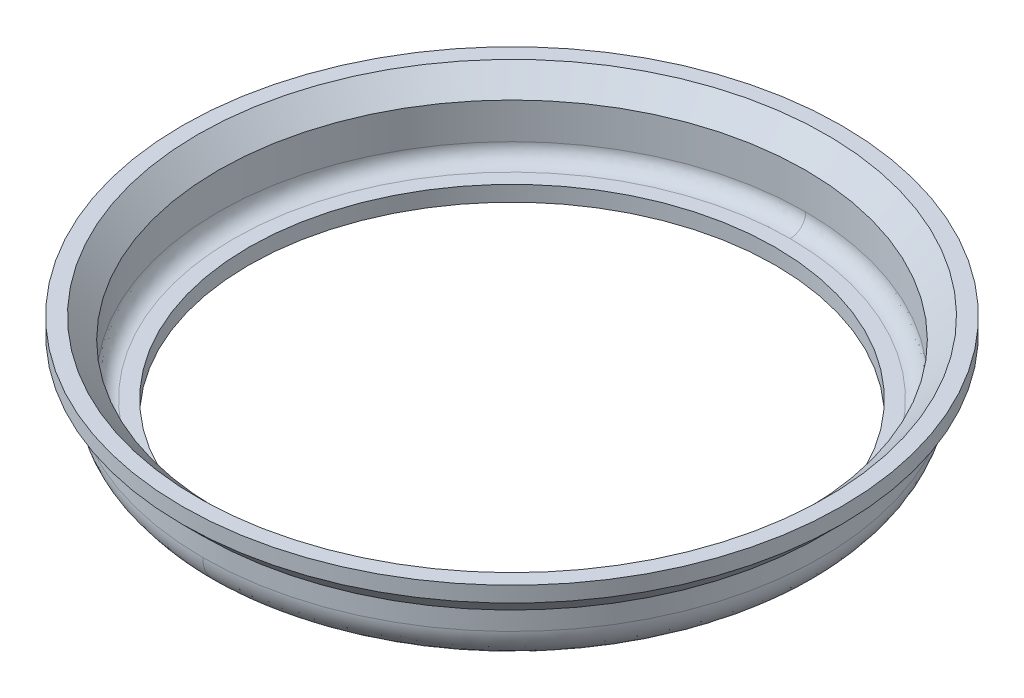
ISO-10303-21;
HEADER;
FILE_DESCRIPTION(('STEP AP214'),'2;1');
FILE_NAME('part.step','',(''),(''),'','','');
FILE_SCHEMA(('AUTOMOTIVE_DESIGN { 1 0 10303 214 1 1 1 1 }'));
ENDSEC;
DATA;
#1=APPLICATION_CONTEXT('core data for automotive mechanical design processes');
#2=APPLICATION_PROTOCOL_DEFINITION('international standard','automotive_design',2000,#1);
#3=PRODUCT_CONTEXT('',#1,'mechanical');
#4=PRODUCT('Part','Part','',(#3));
#5=PRODUCT_RELATED_PRODUCT_CATEGORY('part','',(#4));
#6=PRODUCT_DEFINITION_FORMATION('','',#4);
#7=PRODUCT_DEFINITION_CONTEXT('part definition',#1,'design');
#8=PRODUCT_DEFINITION('design','',#6,#7);
#9=PRODUCT_DEFINITION_SHAPE('','',#8);
#10=(LENGTH_UNIT() NAMED_UNIT(*) SI_UNIT(.MILLI.,.METRE.));
#11=(NAMED_UNIT(*) PLANE_ANGLE_UNIT() SI_UNIT($,.RADIAN.));
#12=(NAMED_UNIT(*) SI_UNIT($,.STERADIAN.) SOLID_ANGLE_UNIT());
#13=UNCERTAINTY_MEASURE_WITH_UNIT(LENGTH_MEASURE(1.E-05),#10,'distance_accuracy_value','');
#14=(GEOMETRIC_REPRESENTATION_CONTEXT(3) GLOBAL_UNCERTAINTY_ASSIGNED_CONTEXT((#13)) GLOBAL_UNIT_ASSIGNED_CONTEXT((#10,
#11,#12)) REPRESENTATION_CONTEXT('',''));
#15=CARTESIAN_POINT('',(0.,0.,0.));
#16=DIRECTION('',(0.,0.,1.));
#17=DIRECTION('',(1.,0.,0.));
#18=AXIS2_PLACEMENT_3D('',#15,#16,#17);
#19=CARTESIAN_POINT('',(-8.225536,2.159,-8.225536));
#20=DIRECTION('',(0.,1.,0.));
#21=DIRECTION('',(0.,0.,1.));
#22=AXIS2_PLACEMENT_3D('',#19,#20,#21);
#23=PLANE('',#22);
#24=CARTESIAN_POINT('',(0.,2.159,0.));
#25=DIRECTION('',(0.,1.,0.));
#26=DIRECTION('',(-1.,0.,0.));
#27=AXIS2_PLACEMENT_3D('',#24,#25,#26);
#28=CIRCLE('',#27,7.747);
#29=CARTESIAN_POINT('',(-7.747,2.159,0.));
#30=VERTEX_POINT('',#29);
#31=EDGE_CURVE('E237',#30,#30,#28,.T.);
#32=ORIENTED_EDGE('',*,*,#31,.F.);
#33=EDGE_LOOP('',(#32));
#34=FACE_BOUND('',#33,.T.);
#35=CARTESIAN_POINT('',(0.,2.159,0.));
#36=DIRECTION('',(0.,-1.,0.));
#37=DIRECTION('',(1.,0.,0.));
#38=AXIS2_PLACEMENT_3D('',#35,#36,#37);
#39=CIRCLE('',#38,8.128);
#40=CARTESIAN_POINT('',(8.128,2.159,0.));
#41=VERTEX_POINT('',#40);
#42=EDGE_CURVE('E21',#41,#41,#39,.F.);
#43=ORIENTED_EDGE('',*,*,#42,.T.);
#44=EDGE_LOOP('',(#43));
#45=FACE_BOUND('',#44,.T.);
#46=ADVANCED_FACE('F16',(#34,#45),#23,.T.);
#47=CARTESIAN_POINT('',(0.,2.159,0.));
#48=DIRECTION('',(0.,-1.,0.));
#49=DIRECTION('',(1.,0.,0.));
#50=AXIS2_PLACEMENT_3D('',#47,#48,#49);
#51=CYLINDRICAL_SURFACE('',#50,8.128);
#52=ORIENTED_EDGE('',*,*,#42,.F.);
#53=EDGE_LOOP('',(#52));
#54=FACE_BOUND('',#53,.T.);
#55=CARTESIAN_POINT('',(0.,1.77799999999995,0.));
#56=DIRECTION('',(0.,1.,0.));
#57=DIRECTION('',(0.,0.,1.));
#58=AXIS2_PLACEMENT_3D('',#55,#56,#57);
#59=CIRCLE('',#58,8.128);
#60=CARTESIAN_POINT('',(0.,1.778,8.128));
#61=VERTEX_POINT('',#60);
#62=EDGE_CURVE('E239',#61,#61,#59,.T.);
#63=ORIENTED_EDGE('',*,*,#62,.T.);
#64=EDGE_LOOP('',(#63));
#65=FACE_BOUND('',#64,.T.);
#66=ADVANCED_FACE('F132',(#54,#65),#51,.T.);
#67=CARTESIAN_POINT('',(0.,1.651,0.));
#68=DIRECTION('',(0.,1.,0.));
#69=DIRECTION('',(-1.,0.,0.));
#70=AXIS2_PLACEMENT_3D('',#67,#68,#69);
#71=CONICAL_SURFACE('',#70,7.239,0.785398163397449);
#72=ORIENTED_EDGE('',*,*,#31,.T.);
#73=EDGE_LOOP('',(#72));
#74=FACE_BOUND('',#73,.T.);
#75=CARTESIAN_POINT('',(0.,1.651,0.));
#76=DIRECTION('',(0.,-1.,0.));
#77=DIRECTION('',(0.,0.,-1.));
#78=AXIS2_PLACEMENT_3D('',#75,#76,#77);
#79=CIRCLE('',#78,7.239);
#80=CARTESIAN_POINT('',(0.,1.651,-7.239));
#81=VERTEX_POINT('',#80);
#82=EDGE_CURVE('E242',#81,#81,#79,.F.);
#83=ORIENTED_EDGE('',*,*,#82,.F.);
#84=EDGE_LOOP('',(#83));
#85=FACE_BOUND('',#84,.T.);
#86=ADVANCED_FACE('F128',(#74,#85),#71,.F.);
#87=CARTESIAN_POINT('',(0.,1.27,0.));
#88=DIRECTION('',(0.,1.,0.));
#89=DIRECTION('',(0.,0.,1.));
#90=AXIS2_PLACEMENT_3D('',#87,#88,#89);
#91=CONICAL_SURFACE('',#90,7.62,0.785398163397448);
#92=CARTESIAN_POINT('',(0.,1.27,0.));
#93=DIRECTION('',(0.,-1.,0.));
#94=DIRECTION('',(0.,0.,-1.));
#95=AXIS2_PLACEMENT_3D('',#92,#93,#94);
#96=CIRCLE('',#95,7.62);
#97=CARTESIAN_POINT('',(0.,1.27,-7.62));
#98=VERTEX_POINT('',#97);
#99=EDGE_CURVE('E67',#98,#98,#96,.F.);
#100=ORIENTED_EDGE('',*,*,#99,.T.);
#101=EDGE_LOOP('',(#100));
#102=FACE_BOUND('',#101,.T.);
#103=ORIENTED_EDGE('',*,*,#62,.F.);
#104=EDGE_LOOP('',(#103));
#105=FACE_BOUND('',#104,.T.);
#106=ADVANCED_FACE('F125',(#102,#105),#91,.T.);
#107=CARTESIAN_POINT('',(0.,1.651,0.));
#108=DIRECTION('',(0.,-1.,0.));
#109=DIRECTION('',(1.,0.,0.));
#110=AXIS2_PLACEMENT_3D('',#107,#108,#109);
#111=CYLINDRICAL_SURFACE('',#110,7.239);
#112=CARTESIAN_POINT('',(0.,0.761999996046152,0.));
#113=DIRECTION('',(0.,-1.,0.));
#114=DIRECTION('',(1.,0.,0.));
#115=AXIS2_PLACEMENT_3D('',#112,#113,#114);
#116=CIRCLE('',#115,7.23899998829524);
#117=CARTESIAN_POINT('',(-4.87512057015322E-10,0.761999996046152,-7.23899999122143));
#118=VERTEX_POINT('',#117);
#119=CARTESIAN_POINT('',(-7.42371859511241E-10,0.761999996046152,7.23899999122143));
#120=VERTEX_POINT('',#119);
#121=EDGE_CURVE('E58',#118,#120,#116,.T.);
#122=ORIENTED_EDGE('',*,*,#121,.T.);
#123=CARTESIAN_POINT('',(0.,0.761999996046152,0.));
#124=DIRECTION('',(0.,-1.,0.));
#125=DIRECTION('',(1.,0.,0.));
#126=AXIS2_PLACEMENT_3D('',#123,#124,#125);
#127=CIRCLE('',#126,7.23899998829524);
#128=EDGE_CURVE('E65',#120,#118,#127,.T.);
#129=ORIENTED_EDGE('',*,*,#128,.T.);
#130=EDGE_LOOP('',(#122,#129));
#131=FACE_BOUND('',#130,.T.);
#132=ORIENTED_EDGE('',*,*,#82,.T.);
#133=EDGE_LOOP('',(#132));
#134=FACE_BOUND('',#133,.T.);
#135=ADVANCED_FACE('F63',(#131,#134),#111,.F.);
#136=CARTESIAN_POINT('',(0.,1.27,0.));
#137=DIRECTION('',(0.,-1.,0.));
#138=DIRECTION('',(0.,0.,-1.));
#139=AXIS2_PLACEMENT_3D('',#136,#137,#138);
#140=CYLINDRICAL_SURFACE('',#139,7.62);
#141=ORIENTED_EDGE('',*,*,#99,.F.);
#142=EDGE_LOOP('',(#141));
#143=FACE_BOUND('',#142,.T.);
#144=CARTESIAN_POINT('',(0.,0.81279999387897,0.));
#145=DIRECTION('',(0.,-1.,0.));
#146=DIRECTION('',(1.,0.,0.));
#147=AXIS2_PLACEMENT_3D('',#144,#145,#146);
#148=CIRCLE('',#147,7.61999999516142);
#149=CARTESIAN_POINT('',(-3.42113724313473E-10,0.812799995409228,-7.61999999637106));
#150=VERTEX_POINT('',#149);
#151=CARTESIAN_POINT('',(-7.81444062643412E-10,0.81279999387897,7.61999999637106));
#152=VERTEX_POINT('',#151);
#153=EDGE_CURVE('E74',#150,#152,#148,.T.);
#154=ORIENTED_EDGE('',*,*,#153,.F.);
#155=CARTESIAN_POINT('',(0.,0.81279999387897,0.));
#156=DIRECTION('',(0.,-1.,0.));
#157=DIRECTION('',(1.,0.,0.));
#158=AXIS2_PLACEMENT_3D('',#155,#156,#157);
#159=CIRCLE('',#158,7.61999999516142);
#160=EDGE_CURVE('E164',#152,#150,#159,.T.);
#161=ORIENTED_EDGE('',*,*,#160,.F.);
#162=EDGE_LOOP('',(#154,#161));
#163=FACE_BOUND('',#162,.T.);
#164=ADVANCED_FACE('F110',(#143,#163),#140,.T.);
#165=CARTESIAN_POINT('',(0.,0.3829034252,-6.8199634746));
#166=CARTESIAN_POINT('',(13.6399269492,0.3829034252,-6.8199634746));
#167=CARTESIAN_POINT('',(13.6399269492,0.3829034252,6.8199634746));
#168=CARTESIAN_POINT('',(0.,0.3829034252,6.8199634746));
#169=CARTESIAN_POINT('',(0.,0.3569130276,-7.0790004724));
#170=CARTESIAN_POINT('',(14.1580009702,0.3569130276,-7.0790004724));
#171=CARTESIAN_POINT('',(14.1580009702,0.3569130276,7.0790004724));
#172=CARTESIAN_POINT('',(0.,0.3569130276,7.0790004724));
#173=CARTESIAN_POINT('',(0.,0.5409995276,-7.2630869724));
#174=CARTESIAN_POINT('',(14.5261739702,0.5409995276,-7.2630869724));
#175=CARTESIAN_POINT('',(14.5261739702,0.5409995276,7.2630869724));
#176=CARTESIAN_POINT('',(0.,0.5409995276,7.2630869724));
#177=CARTESIAN_POINT('',(0.,0.8000365254,-7.2370965748));
#178=CARTESIAN_POINT('',(14.474193175,0.8000365254,-7.2370965748));
#179=CARTESIAN_POINT('',(14.474193175,0.8000365254,7.2370965748));
#180=CARTESIAN_POINT('',(0.,0.8000365254,7.2370965748));
#181=(BOUNDED_SURFACE() B_SPLINE_SURFACE(3,3,((#165,#166,#167,#168),(#169,#170,#171,#172),(#173,
#174,#175,#176),(#177,#178,#179,#180)),.UNSPECIFIED.,.F.,.F.,
.F.) B_SPLINE_SURFACE_WITH_KNOTS((4,4),(4,4),(0.,1.),(0.,1.),
.UNSPECIFIED.) GEOMETRIC_REPRESENTATION_ITEM() RATIONAL_B_SPLINE_SURFACE(((1.,0.333333333333333,
0.333333333333333,1.),(0.755320871117972,0.251773623705991,0.251773623705991,0.755320871117972),
(0.755320871117972,0.251773623705991,0.251773623705991,0.755320871117972),(1.,0.333333333333333,
0.333333333333333,1.))) REPRESENTATION_ITEM('') SURFACE());
#182=CARTESIAN_POINT('',(0.,0.3829034252,-6.8199634746));
#183=CARTESIAN_POINT('',(0.,0.3569130276,-7.0790004724));
#184=CARTESIAN_POINT('',(0.,0.5409995276,-7.2630869724));
#185=CARTESIAN_POINT('',(0.,0.8000365254,-7.2370965748));
#186=(BOUNDED_CURVE() B_SPLINE_CURVE(3,(#182,#183,#184,#185),.UNSPECIFIED.,.F.,
.F.) B_SPLINE_CURVE_WITH_KNOTS((4,4),(0.,1.),
.UNSPECIFIED.) CURVE() GEOMETRIC_REPRESENTATION_ITEM() RATIONAL_B_SPLINE_CURVE((1.,
0.755320871117972,0.755320871117972,1.)) REPRESENTATION_ITEM(''));
#187=CARTESIAN_POINT('',(0.,0.381000007022858,-6.85800000065266));
#188=VERTEX_POINT('',#187);
#189=EDGE_CURVE('E66',#118,#188,#186,.F.);
#190=CARTESIAN_POINT('',(0.,0.381000011704763,-6.85800000305629));
#191=CARTESIAN_POINT('',(13.7160000096785,0.381000011704763,-6.85800000305629));
#192=CARTESIAN_POINT('',(13.7160000096785,0.381000011704763,6.85800000305629));
#193=CARTESIAN_POINT('',(0.,0.381000011704763,6.85800000305629));
#194=(BOUNDED_CURVE() B_SPLINE_CURVE(3,(#190,#191,#192,#193),.UNSPECIFIED.,.F.,
.F.) B_SPLINE_CURVE_WITH_KNOTS((4,4),(0.,1.),
.UNSPECIFIED.) CURVE() GEOMETRIC_REPRESENTATION_ITEM() RATIONAL_B_SPLINE_CURVE((0.956578303099426,
0.318859434366475,0.318859434366475,0.956578303099426)) REPRESENTATION_ITEM(''));
#195=CARTESIAN_POINT('',(0.,0.381000007022858,6.85800000065266));
#196=VERTEX_POINT('',#195);
#197=EDGE_CURVE('E78',#196,#188,#194,.F.);
#198=CARTESIAN_POINT('',(0.,0.3829034252,6.8199634746));
#199=CARTESIAN_POINT('',(0.,0.3569130276,7.0790004724));
#200=CARTESIAN_POINT('',(0.,0.5409995276,7.2630869724));
#201=CARTESIAN_POINT('',(0.,0.8000365254,7.2370965748));
#202=(BOUNDED_CURVE() B_SPLINE_CURVE(3,(#198,#199,#200,#201),.UNSPECIFIED.,.F.,
.F.) B_SPLINE_CURVE_WITH_KNOTS((4,4),(0.,1.),
.UNSPECIFIED.) CURVE() GEOMETRIC_REPRESENTATION_ITEM() RATIONAL_B_SPLINE_CURVE((1.,
0.755320871117972,0.755320871117972,1.)) REPRESENTATION_ITEM(''));
#203=EDGE_CURVE('E72',#196,#120,#202,.T.);
#204=ORIENTED_EDGE('',*,*,#121,.F.);
#205=ORIENTED_EDGE('',*,*,#189,.T.);
#206=ORIENTED_EDGE('',*,*,#197,.F.);
#207=ORIENTED_EDGE('',*,*,#203,.T.);
#208=EDGE_LOOP('',(#204,#205,#206,#207));
#209=FACE_BOUND('',#208,.T.);
#210=ADVANCED_FACE('F77',(#209),#181,.F.);
#211=CARTESIAN_POINT('',(0.,0.3829034252,6.8199634746));
#212=CARTESIAN_POINT('',(-13.6399269492,0.3829034252,6.8199634746));
#213=CARTESIAN_POINT('',(-13.6399269492,0.3829034252,-6.8199634746));
#214=CARTESIAN_POINT('',(0.,0.3829034252,-6.8199634746));
#215=CARTESIAN_POINT('',(0.,0.3569130276,7.0790004724));
#216=CARTESIAN_POINT('',(-14.1580009702,0.3569130276,7.0790004724));
#217=CARTESIAN_POINT('',(-14.1580009702,0.3569130276,-7.0790004724));
#218=CARTESIAN_POINT('',(0.,0.3569130276,-7.0790004724));
#219=CARTESIAN_POINT('',(0.,0.5409995276,7.2630869724));
#220=CARTESIAN_POINT('',(-14.5261739702,0.5409995276,7.2630869724));
#221=CARTESIAN_POINT('',(-14.5261739702,0.5409995276,-7.2630869724));
#222=CARTESIAN_POINT('',(0.,0.5409995276,-7.2630869724));
#223=CARTESIAN_POINT('',(0.,0.8000365254,7.2370965748));
#224=CARTESIAN_POINT('',(-14.474193175,0.8000365254,7.2370965748));
#225=CARTESIAN_POINT('',(-14.474193175,0.8000365254,-7.2370965748));
#226=CARTESIAN_POINT('',(0.,0.8000365254,-7.2370965748));
#227=(BOUNDED_SURFACE() B_SPLINE_SURFACE(3,3,((#211,#212,#213,#214),(#215,#216,#217,#218),(#219,
#220,#221,#222),(#223,#224,#225,#226)),.UNSPECIFIED.,.F.,.F.,
.F.) B_SPLINE_SURFACE_WITH_KNOTS((4,4),(4,4),(0.,1.),(0.,1.),
.UNSPECIFIED.) GEOMETRIC_REPRESENTATION_ITEM() RATIONAL_B_SPLINE_SURFACE(((1.,0.333333333333333,
0.333333333333333,1.),(0.755320871117972,0.251773623705991,0.251773623705991,0.755320871117972),
(0.755320871117972,0.251773623705991,0.251773623705991,0.755320871117972),(1.,0.333333333333333,
0.333333333333333,1.))) REPRESENTATION_ITEM('') SURFACE());
#228=CARTESIAN_POINT('',(0.,0.381000011704763,6.85800000305629));
#229=CARTESIAN_POINT('',(-13.7160000096785,0.381000011704763,6.85800000305629));
#230=CARTESIAN_POINT('',(-13.7160000096785,0.381000011704763,-6.85800000305629));
#231=CARTESIAN_POINT('',(0.,0.381000011704763,-6.85800000305629));
#232=(BOUNDED_CURVE() B_SPLINE_CURVE(3,(#228,#229,#230,#231),.UNSPECIFIED.,.F.,
.F.) B_SPLINE_CURVE_WITH_KNOTS((4,4),(0.,1.),
.UNSPECIFIED.) CURVE() GEOMETRIC_REPRESENTATION_ITEM() RATIONAL_B_SPLINE_CURVE((0.956578303099424,
0.318859434366475,0.318859434366475,0.956578303099424)) REPRESENTATION_ITEM(''));
#233=EDGE_CURVE('E160',#188,#196,#232,.F.);
#234=ORIENTED_EDGE('',*,*,#203,.F.);
#235=ORIENTED_EDGE('',*,*,#233,.F.);
#236=ORIENTED_EDGE('',*,*,#189,.F.);
#237=ORIENTED_EDGE('',*,*,#128,.F.);
#238=EDGE_LOOP('',(#234,#235,#236,#237));
#239=FACE_BOUND('',#238,.T.);
#240=ADVANCED_FACE('F70',(#239),#227,.F.);
#241=CARTESIAN_POINT('',(0.,0.0040606218,-6.7260554074));
#242=CARTESIAN_POINT('',(13.4521107894,0.0040606218,-6.7260554074));
#243=CARTESIAN_POINT('',(13.4521107894,0.0040606218,6.7260554074));
#244=CARTESIAN_POINT('',(0.,0.0040606218,6.7260554074));
#245=CARTESIAN_POINT('',(0.,-0.0513855716,-7.278667688));
#246=CARTESIAN_POINT('',(14.5573354014,-0.0513855716,-7.278667688));
#247=CARTESIAN_POINT('',(14.5573354014,-0.0513855716,7.278667688));
#248=CARTESIAN_POINT('',(0.,-0.0513855716,7.278667688));
#249=CARTESIAN_POINT('',(0.,0.341332312,-7.6713855716));
#250=CARTESIAN_POINT('',(15.3427711178,0.341332312,-7.6713855716));
#251=CARTESIAN_POINT('',(15.3427711178,0.341332312,7.6713855716));
#252=CARTESIAN_POINT('',(0.,0.341332312,7.6713855716));
#253=CARTESIAN_POINT('',(0.,0.8939445926,-7.6159393782));
#254=CARTESIAN_POINT('',(15.2318787818,0.8939445926,-7.6159393782));
#255=CARTESIAN_POINT('',(15.2318787818,0.8939445926,7.6159393782));
#256=CARTESIAN_POINT('',(0.,0.8939445926,7.6159393782));
#257=(BOUNDED_SURFACE() B_SPLINE_SURFACE(3,3,((#241,#242,#243,#244),(#245,#246,#247,#248),(#249,
#250,#251,#252),(#253,#254,#255,#256)),.UNSPECIFIED.,.F.,.F.,
.F.) B_SPLINE_SURFACE_WITH_KNOTS((4,4),(4,4),(0.,1.),(0.,1.),
.UNSPECIFIED.) GEOMETRIC_REPRESENTATION_ITEM() RATIONAL_B_SPLINE_SURFACE(((1.,0.333333333333333,
0.333333333333333,1.),(0.755320871117972,0.251773623705991,0.251773623705991,0.755320871117972),
(0.755320871117972,0.251773623705991,0.251773623705991,0.755320871117972),(1.,0.333333333333333,
0.333333333333333,1.))) REPRESENTATION_ITEM('') SURFACE());
#258=CARTESIAN_POINT('',(0.,4.83858712685819E-09,6.80720001083274));
#259=CARTESIAN_POINT('',(13.6144000029478,4.83858711952322E-09,6.80720001083274));
#260=CARTESIAN_POINT('',(13.6144000029478,4.83858711952322E-09,-6.80720001083274));
#261=CARTESIAN_POINT('',(0.,4.83858712685819E-09,-6.80720001083274));
#262=(BOUNDED_CURVE() B_SPLINE_CURVE(3,(#258,#259,#260,#261),.UNSPECIFIED.,.F.,
.F.) B_SPLINE_CURVE_WITH_KNOTS((4,4),(0.,1.),
.UNSPECIFIED.) CURVE() GEOMETRIC_REPRESENTATION_ITEM() RATIONAL_B_SPLINE_CURVE((0.956578299869106,
0.318859433289702,0.318859433289702,0.956578299869106)) REPRESENTATION_ITEM(''));
#263=CARTESIAN_POINT('',(0.,2.90315229858622E-09,-6.80720000420675));
#264=VERTEX_POINT('',#263);
#265=CARTESIAN_POINT('',(0.,2.90315229858622E-09,6.80720000420675));
#266=VERTEX_POINT('',#265);
#267=EDGE_CURVE('E35',#264,#266,#262,.F.);
#268=CARTESIAN_POINT('',(0.,0.0040606218,-6.7260554074));
#269=CARTESIAN_POINT('',(0.,-0.0513855716,-7.278667688));
#270=CARTESIAN_POINT('',(0.,0.341332312,-7.6713855716));
#271=CARTESIAN_POINT('',(0.,0.8939445926,-7.6159393782));
#272=(BOUNDED_CURVE() B_SPLINE_CURVE(3,(#268,#269,#270,#271),.UNSPECIFIED.,.F.,
.F.) B_SPLINE_CURVE_WITH_KNOTS((4,4),(0.,1.),
.UNSPECIFIED.) CURVE() GEOMETRIC_REPRESENTATION_ITEM() RATIONAL_B_SPLINE_CURVE((1.,
0.755320871117972,0.755320871117972,1.)) REPRESENTATION_ITEM(''));
#273=EDGE_CURVE('E163',#150,#264,#272,.F.);
#274=CARTESIAN_POINT('',(0.,0.0040606218,6.7260554074));
#275=CARTESIAN_POINT('',(0.,-0.0513855716,7.278667688));
#276=CARTESIAN_POINT('',(0.,0.341332312,7.6713855716));
#277=CARTESIAN_POINT('',(0.,0.8939445926,7.6159393782));
#278=(BOUNDED_CURVE() B_SPLINE_CURVE(3,(#274,#275,#276,#277),.UNSPECIFIED.,.F.,
.F.) B_SPLINE_CURVE_WITH_KNOTS((4,4),(0.,1.),
.UNSPECIFIED.) CURVE() GEOMETRIC_REPRESENTATION_ITEM() RATIONAL_B_SPLINE_CURVE((1.,
0.755320871117972,0.755320871117972,1.)) REPRESENTATION_ITEM(''));
#279=EDGE_CURVE('E169',#266,#152,#278,.T.);
#280=ORIENTED_EDGE('',*,*,#267,.F.);
#281=ORIENTED_EDGE('',*,*,#273,.F.);
#282=ORIENTED_EDGE('',*,*,#153,.T.);
#283=ORIENTED_EDGE('',*,*,#279,.F.);
#284=EDGE_LOOP('',(#280,#281,#282,#283));
#285=FACE_BOUND('',#284,.T.);
#286=ADVANCED_FACE('F198',(#285),#257,.T.);
#287=CARTESIAN_POINT('',(0.,0.0040606218,6.7260554074));
#288=CARTESIAN_POINT('',(-13.4521107894,0.0040606218,6.7260554074));
#289=CARTESIAN_POINT('',(-13.4521107894,0.0040606218,-6.7260554074));
#290=CARTESIAN_POINT('',(0.,0.0040606218,-6.7260554074));
#291=CARTESIAN_POINT('',(0.,-0.0513855716,7.278667688));
#292=CARTESIAN_POINT('',(-14.5573354014,-0.0513855716,7.278667688));
#293=CARTESIAN_POINT('',(-14.5573354014,-0.0513855716,-7.278667688));
#294=CARTESIAN_POINT('',(0.,-0.0513855716,-7.278667688));
#295=CARTESIAN_POINT('',(0.,0.341332312,7.6713855716));
#296=CARTESIAN_POINT('',(-15.3427711178,0.341332312,7.6713855716));
#297=CARTESIAN_POINT('',(-15.3427711178,0.341332312,-7.6713855716));
#298=CARTESIAN_POINT('',(0.,0.341332312,-7.6713855716));
#299=CARTESIAN_POINT('',(0.,0.8939445926,7.6159393782));
#300=CARTESIAN_POINT('',(-15.2318787818,0.8939445926,7.6159393782));
#301=CARTESIAN_POINT('',(-15.2318787818,0.8939445926,-7.6159393782));
#302=CARTESIAN_POINT('',(0.,0.8939445926,-7.6159393782));
#303=(BOUNDED_SURFACE() B_SPLINE_SURFACE(3,3,((#287,#288,#289,#290),(#291,#292,#293,#294),(#295,
#296,#297,#298),(#299,#300,#301,#302)),.UNSPECIFIED.,.F.,.F.,
.F.) B_SPLINE_SURFACE_WITH_KNOTS((4,4),(4,4),(0.,1.),(0.,1.),
.UNSPECIFIED.) GEOMETRIC_REPRESENTATION_ITEM() RATIONAL_B_SPLINE_SURFACE(((1.,0.333333333333333,
0.333333333333333,1.),(0.755320871117972,0.251773623705991,0.251773623705991,0.755320871117972),
(0.755320871117972,0.251773623705991,0.251773623705991,0.755320871117972),(1.,0.333333333333333,
0.333333333333333,1.))) REPRESENTATION_ITEM('') SURFACE());
#304=CARTESIAN_POINT('',(0.,4.83858712749409E-09,-6.80720001083274));
#305=CARTESIAN_POINT('',(-13.6144000029478,4.83858711905406E-09,-6.80720001083274));
#306=CARTESIAN_POINT('',(-13.6144000029478,4.83858711905406E-09,6.80720001083274));
#307=CARTESIAN_POINT('',(0.,4.83858712749409E-09,6.80720001083274));
#308=(BOUNDED_CURVE() B_SPLINE_CURVE(3,(#304,#305,#306,#307),.UNSPECIFIED.,.F.,
.F.) B_SPLINE_CURVE_WITH_KNOTS((4,4),(0.,1.),
.UNSPECIFIED.) CURVE() GEOMETRIC_REPRESENTATION_ITEM() RATIONAL_B_SPLINE_CURVE((0.956578299869106,
0.318859433289702,0.318859433289702,0.956578299869106)) REPRESENTATION_ITEM(''));
#309=EDGE_CURVE('E162',#266,#264,#308,.F.);
#310=ORIENTED_EDGE('',*,*,#273,.T.);
#311=ORIENTED_EDGE('',*,*,#309,.F.);
#312=ORIENTED_EDGE('',*,*,#279,.T.);
#313=ORIENTED_EDGE('',*,*,#160,.T.);
#314=EDGE_LOOP('',(#310,#311,#312,#313));
#315=FACE_BOUND('',#314,.T.);
#316=ADVANCED_FACE('F142',(#315),#303,.T.);
#317=CARTESIAN_POINT('',(-6.940296,0.381,-6.940296));
#318=DIRECTION('',(0.,1.,0.));
#319=DIRECTION('',(0.,0.,1.));
#320=AXIS2_PLACEMENT_3D('',#317,#318,#319);
#321=PLANE('',#320);
#322=CARTESIAN_POINT('',(0.,0.381,0.));
#323=DIRECTION('',(0.,-1.,0.));
#324=DIRECTION('',(1.,0.,0.));
#325=AXIS2_PLACEMENT_3D('',#322,#323,#324);
#326=CIRCLE('',#325,6.4897);
#327=CARTESIAN_POINT('',(6.4897,0.381,0.));
#328=VERTEX_POINT('',#327);
#329=EDGE_CURVE('E27',#328,#328,#326,.F.);
#330=ORIENTED_EDGE('',*,*,#329,.F.);
#331=EDGE_LOOP('',(#330));
#332=FACE_BOUND('',#331,.T.);
#333=ORIENTED_EDGE('',*,*,#197,.T.);
#334=ORIENTED_EDGE('',*,*,#233,.T.);
#335=EDGE_LOOP('',(#333,#334));
#336=FACE_BOUND('',#335,.T.);
#337=ADVANCED_FACE('F139',(#332,#336),#321,.T.);
#338=CARTESIAN_POINT('',(-6.8888864,0.,6.8888864));
#339=DIRECTION('',(0.,-1.,0.));
#340=DIRECTION('',(0.,0.,-1.));
#341=AXIS2_PLACEMENT_3D('',#338,#339,#340);
#342=PLANE('',#341);
#343=CARTESIAN_POINT('',(0.,0.,0.));
#344=DIRECTION('',(0.,-1.,0.));
#345=DIRECTION('',(1.,0.,0.));
#346=AXIS2_PLACEMENT_3D('',#343,#344,#345);
#347=CIRCLE('',#346,6.4897);
#348=CARTESIAN_POINT('',(6.4897,0.,0.));
#349=VERTEX_POINT('',#348);
#350=EDGE_CURVE('E11',#349,#349,#347,.T.);
#351=ORIENTED_EDGE('',*,*,#350,.F.);
#352=EDGE_LOOP('',(#351));
#353=FACE_BOUND('',#352,.T.);
#354=ORIENTED_EDGE('',*,*,#267,.T.);
#355=ORIENTED_EDGE('',*,*,#309,.T.);
#356=EDGE_LOOP('',(#354,#355));
#357=FACE_BOUND('',#356,.T.);
#358=ADVANCED_FACE('F18',(#353,#357),#342,.T.);
#359=CARTESIAN_POINT('',(0.,0.381,0.));
#360=DIRECTION('',(0.,-1.,0.));
#361=DIRECTION('',(1.,0.,0.));
#362=AXIS2_PLACEMENT_3D('',#359,#360,#361);
#363=CYLINDRICAL_SURFACE('',#362,6.4897);
#364=ORIENTED_EDGE('',*,*,#329,.T.);
#365=EDGE_LOOP('',(#364));
#366=FACE_BOUND('',#365,.T.);
#367=ORIENTED_EDGE('',*,*,#350,.T.);
#368=EDGE_LOOP('',(#367));
#369=FACE_BOUND('',#368,.T.);
#370=ADVANCED_FACE('F218',(#366,#369),#363,.F.);
#371=CLOSED_SHELL('',(#46,#66,#86,#106,#135,#164,#210,#240,#286,#316,#337,#358,#370));
#372=MANIFOLD_SOLID_BREP('B1',#371);
#373=ADVANCED_BREP_SHAPE_REPRESENTATION('',(#18,#372),#14);
#374=SHAPE_DEFINITION_REPRESENTATION(#9,#373);
ENDSEC;
END-ISO-10303-21;
